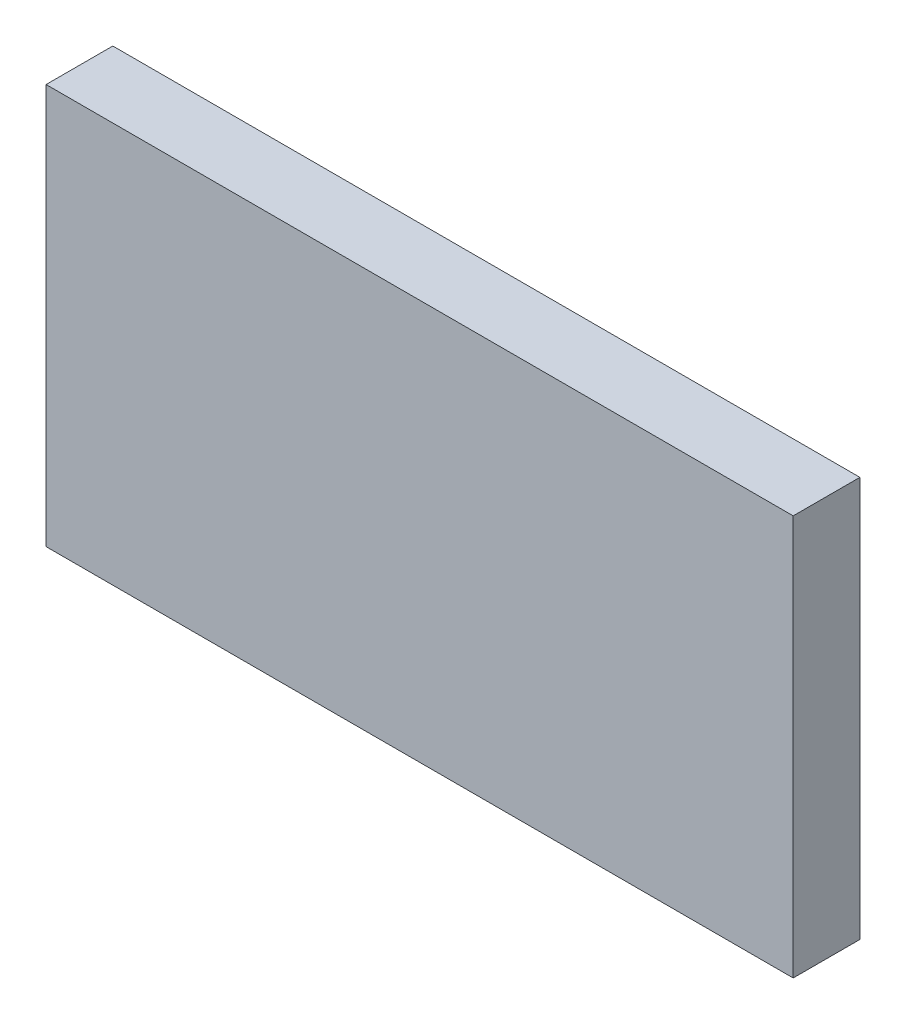
ISO-10303-21;
HEADER;
FILE_DESCRIPTION(('STEP AP214'),'2;1');
FILE_NAME('part.step','',(''),(''),'','','');
FILE_SCHEMA(('AUTOMOTIVE_DESIGN { 1 0 10303 214 1 1 1 1 }'));
ENDSEC;
DATA;
#1=APPLICATION_CONTEXT('core data for automotive mechanical design processes');
#2=APPLICATION_PROTOCOL_DEFINITION('international standard','automotive_design',2000,#1);
#3=PRODUCT_CONTEXT('',#1,'mechanical');
#4=PRODUCT('Part','Part','',(#3));
#5=PRODUCT_RELATED_PRODUCT_CATEGORY('part','',(#4));
#6=PRODUCT_DEFINITION_FORMATION('','',#4);
#7=PRODUCT_DEFINITION_CONTEXT('part definition',#1,'design');
#8=PRODUCT_DEFINITION('design','',#6,#7);
#9=PRODUCT_DEFINITION_SHAPE('','',#8);
#10=(LENGTH_UNIT() NAMED_UNIT(*) SI_UNIT(.MILLI.,.METRE.));
#11=(NAMED_UNIT(*) PLANE_ANGLE_UNIT() SI_UNIT($,.RADIAN.));
#12=(NAMED_UNIT(*) SI_UNIT($,.STERADIAN.) SOLID_ANGLE_UNIT());
#13=UNCERTAINTY_MEASURE_WITH_UNIT(LENGTH_MEASURE(1.E-05),#10,'distance_accuracy_value','');
#14=(GEOMETRIC_REPRESENTATION_CONTEXT(3) GLOBAL_UNCERTAINTY_ASSIGNED_CONTEXT((#13)) GLOBAL_UNIT_ASSIGNED_CONTEXT((#10,
#11,#12)) REPRESENTATION_CONTEXT('',''));
#15=CARTESIAN_POINT('',(0.,0.,0.));
#16=DIRECTION('',(0.,0.,1.));
#17=DIRECTION('',(1.,0.,0.));
#18=AXIS2_PLACEMENT_3D('',#15,#16,#17);
#19=CARTESIAN_POINT('',(-1.21972271238837,-0.654793790709493,0.0826433070866142));
#20=DIRECTION('',(0.,0.,1.));
#21=DIRECTION('',(0.,-1.,0.));
#22=AXIS2_PLACEMENT_3D('',#19,#20,#21);
#23=PLANE('',#22);
#24=DIRECTION('',(0.,1.,0.));
#25=VECTOR('',#24,1.);
#26=CARTESIAN_POINT('',(-1.29380145254586,-0.654793790709493,0.0826433070866142));
#27=LINE('',#26,#25);
#28=CARTESIAN_POINT('',(-1.29380145254586,-0.652904026929966,0.0826433070866142));
#29=VERTEX_POINT('',#28);
#30=CARTESIAN_POINT('',(-1.29380145254586,-0.615108751339415,0.0826433070866142));
#31=VERTEX_POINT('',#30);
#32=EDGE_CURVE('E71',#29,#31,#27,.T.);
#33=ORIENTED_EDGE('',*,*,#32,.T.);
#34=DIRECTION('',(1.,0.,0.));
#35=VECTOR('',#34,1.);
#36=CARTESIAN_POINT('',(-1.21972271238837,-0.615108751339415,0.0826433070866142));
#37=LINE('',#36,#35);
#38=CARTESIAN_POINT('',(-1.22325027144349,-0.615108751339415,0.0826433070866142));
#39=VERTEX_POINT('',#38);
#40=EDGE_CURVE('E54',#39,#31,#37,.F.);
#41=ORIENTED_EDGE('',*,*,#40,.F.);
#42=DIRECTION('',(0.,1.,0.));
#43=VECTOR('',#42,1.);
#44=CARTESIAN_POINT('',(-1.22325027144349,-0.654793790709493,0.0826433070866142));
#45=LINE('',#44,#43);
#46=CARTESIAN_POINT('',(-1.22325027144349,-0.652904026929966,0.0826433070866142));
#47=VERTEX_POINT('',#46);
#48=EDGE_CURVE('E20',#47,#39,#45,.T.);
#49=ORIENTED_EDGE('',*,*,#48,.F.);
#50=DIRECTION('',(1.,0.,0.));
#51=VECTOR('',#50,1.);
#52=CARTESIAN_POINT('',(-1.29732901160097,-0.652904026929966,0.0826433070866142));
#53=LINE('',#52,#51);
#54=EDGE_CURVE('E81',#29,#47,#53,.T.);
#55=ORIENTED_EDGE('',*,*,#54,.F.);
#56=EDGE_LOOP('',(#33,#41,#49,#55));
#57=FACE_BOUND('',#56,.T.);
#58=ADVANCED_FACE('F17',(#57),#23,.F.);
#59=CARTESIAN_POINT('',(-1.22325027144349,-0.654793790709493,0.0823283464566929));
#60=DIRECTION('',(-1.,0.,0.));
#61=DIRECTION('',(0.,0.,1.));
#62=AXIS2_PLACEMENT_3D('',#59,#60,#61);
#63=PLANE('',#62);
#64=DIRECTION('',(0.,0.,1.));
#65=VECTOR('',#64,1.);
#66=CARTESIAN_POINT('',(-1.22325027144349,-0.652904026929966,0.0823283464566929));
#67=LINE('',#66,#65);
#68=CARTESIAN_POINT('',(-1.22325027144349,-0.652904026929966,0.0889425196850394));
#69=VERTEX_POINT('',#68);
#70=EDGE_CURVE('E64',#47,#69,#67,.T.);
#71=ORIENTED_EDGE('',*,*,#70,.F.);
#72=ORIENTED_EDGE('',*,*,#48,.T.);
#73=DIRECTION('',(0.,0.,-1.));
#74=VECTOR('',#73,1.);
#75=CARTESIAN_POINT('',(-1.22325027144349,-0.615108751339415,0.0823283464566929));
#76=LINE('',#75,#74);
#77=CARTESIAN_POINT('',(-1.22325027144349,-0.615108751339415,0.0889425196850394));
#78=VERTEX_POINT('',#77);
#79=EDGE_CURVE('E62',#78,#39,#76,.T.);
#80=ORIENTED_EDGE('',*,*,#79,.F.);
#81=DIRECTION('',(0.,1.,0.));
#82=VECTOR('',#81,1.);
#83=CARTESIAN_POINT('',(-1.22325027144349,-0.654793790709493,0.0889425196850394));
#84=LINE('',#83,#82);
#85=EDGE_CURVE('E83',#69,#78,#84,.T.);
#86=ORIENTED_EDGE('',*,*,#85,.F.);
#87=EDGE_LOOP('',(#71,#72,#80,#86));
#88=FACE_BOUND('',#87,.T.);
#89=ADVANCED_FACE('F60',(#88),#63,.F.);
#90=CARTESIAN_POINT('',(-1.21972271238837,-0.615108751339415,0.0823283464566929));
#91=DIRECTION('',(0.,-1.,0.));
#92=DIRECTION('',(0.,0.,-1.));
#93=AXIS2_PLACEMENT_3D('',#90,#91,#92);
#94=PLANE('',#93);
#95=DIRECTION('',(0.,0.,1.));
#96=VECTOR('',#95,1.);
#97=CARTESIAN_POINT('',(-1.29380145254586,-0.615108751339415,0.0823283464566929));
#98=LINE('',#97,#96);
#99=CARTESIAN_POINT('',(-1.29380145254586,-0.615108751339415,0.0889425196850394));
#100=VERTEX_POINT('',#99);
#101=EDGE_CURVE('E73',#31,#100,#98,.T.);
#102=ORIENTED_EDGE('',*,*,#101,.T.);
#103=DIRECTION('',(1.,0.,0.));
#104=VECTOR('',#103,1.);
#105=CARTESIAN_POINT('',(-1.21972271238837,-0.615108751339415,0.0889425196850394));
#106=LINE('',#105,#104);
#107=EDGE_CURVE('E69',#78,#100,#106,.F.);
#108=ORIENTED_EDGE('',*,*,#107,.F.);
#109=ORIENTED_EDGE('',*,*,#79,.T.);
#110=ORIENTED_EDGE('',*,*,#40,.T.);
#111=EDGE_LOOP('',(#102,#108,#109,#110));
#112=FACE_BOUND('',#111,.T.);
#113=ADVANCED_FACE('F68',(#112),#94,.F.);
#114=CARTESIAN_POINT('',(-1.29380145254586,-0.654793790709493,0.0823283464566929));
#115=DIRECTION('',(-1.,0.,0.));
#116=DIRECTION('',(0.,0.,1.));
#117=AXIS2_PLACEMENT_3D('',#114,#115,#116);
#118=PLANE('',#117);
#119=ORIENTED_EDGE('',*,*,#32,.F.);
#120=DIRECTION('',(0.,0.,1.));
#121=VECTOR('',#120,1.);
#122=CARTESIAN_POINT('',(-1.29380145254586,-0.652904026929966,0.0823283464566929));
#123=LINE('',#122,#121);
#124=CARTESIAN_POINT('',(-1.29380145254586,-0.652904026929966,0.0889425196850394));
#125=VERTEX_POINT('',#124);
#126=EDGE_CURVE('E78',#125,#29,#123,.F.);
#127=ORIENTED_EDGE('',*,*,#126,.F.);
#128=DIRECTION('',(0.,1.,0.));
#129=VECTOR('',#128,1.);
#130=CARTESIAN_POINT('',(-1.29380145254586,-0.654793790709493,0.0889425196850394));
#131=LINE('',#130,#129);
#132=EDGE_CURVE('E26',#100,#125,#131,.F.);
#133=ORIENTED_EDGE('',*,*,#132,.F.);
#134=ORIENTED_EDGE('',*,*,#101,.F.);
#135=EDGE_LOOP('',(#119,#127,#133,#134));
#136=FACE_BOUND('',#135,.T.);
#137=ADVANCED_FACE('F88',(#136),#118,.T.);
#138=CARTESIAN_POINT('',(-1.29732901160097,-0.652904026929966,0.0823283464566929));
#139=DIRECTION('',(0.,1.,0.));
#140=DIRECTION('',(0.,0.,1.));
#141=AXIS2_PLACEMENT_3D('',#138,#139,#140);
#142=PLANE('',#141);
#143=ORIENTED_EDGE('',*,*,#126,.T.);
#144=ORIENTED_EDGE('',*,*,#54,.T.);
#145=ORIENTED_EDGE('',*,*,#70,.T.);
#146=DIRECTION('',(1.,0.,0.));
#147=VECTOR('',#146,1.);
#148=CARTESIAN_POINT('',(-1.21972271238837,-0.652904026929966,0.0889425196850394));
#149=LINE('',#148,#147);
#150=EDGE_CURVE('E11',#125,#69,#149,.T.);
#151=ORIENTED_EDGE('',*,*,#150,.F.);
#152=EDGE_LOOP('',(#143,#144,#145,#151));
#153=FACE_BOUND('',#152,.T.);
#154=ADVANCED_FACE('F91',(#153),#142,.F.);
#155=CARTESIAN_POINT('',(-1.21972271238837,-0.654793790709493,0.0889425196850394));
#156=DIRECTION('',(0.,0.,-1.));
#157=DIRECTION('',(0.,1.,0.));
#158=AXIS2_PLACEMENT_3D('',#155,#156,#157);
#159=PLANE('',#158);
#160=ORIENTED_EDGE('',*,*,#132,.T.);
#161=ORIENTED_EDGE('',*,*,#150,.T.);
#162=ORIENTED_EDGE('',*,*,#85,.T.);
#163=ORIENTED_EDGE('',*,*,#107,.T.);
#164=EDGE_LOOP('',(#160,#161,#162,#163));
#165=FACE_BOUND('',#164,.T.);
#166=ADVANCED_FACE('F86',(#165),#159,.F.);
#167=CLOSED_SHELL('',(#58,#89,#113,#137,#154,#166));
#168=MANIFOLD_SOLID_BREP('B1',#167);
#169=ADVANCED_BREP_SHAPE_REPRESENTATION('',(#18,#168),#14);
#170=SHAPE_DEFINITION_REPRESENTATION(#9,#169);
ENDSEC;
END-ISO-10303-21;
